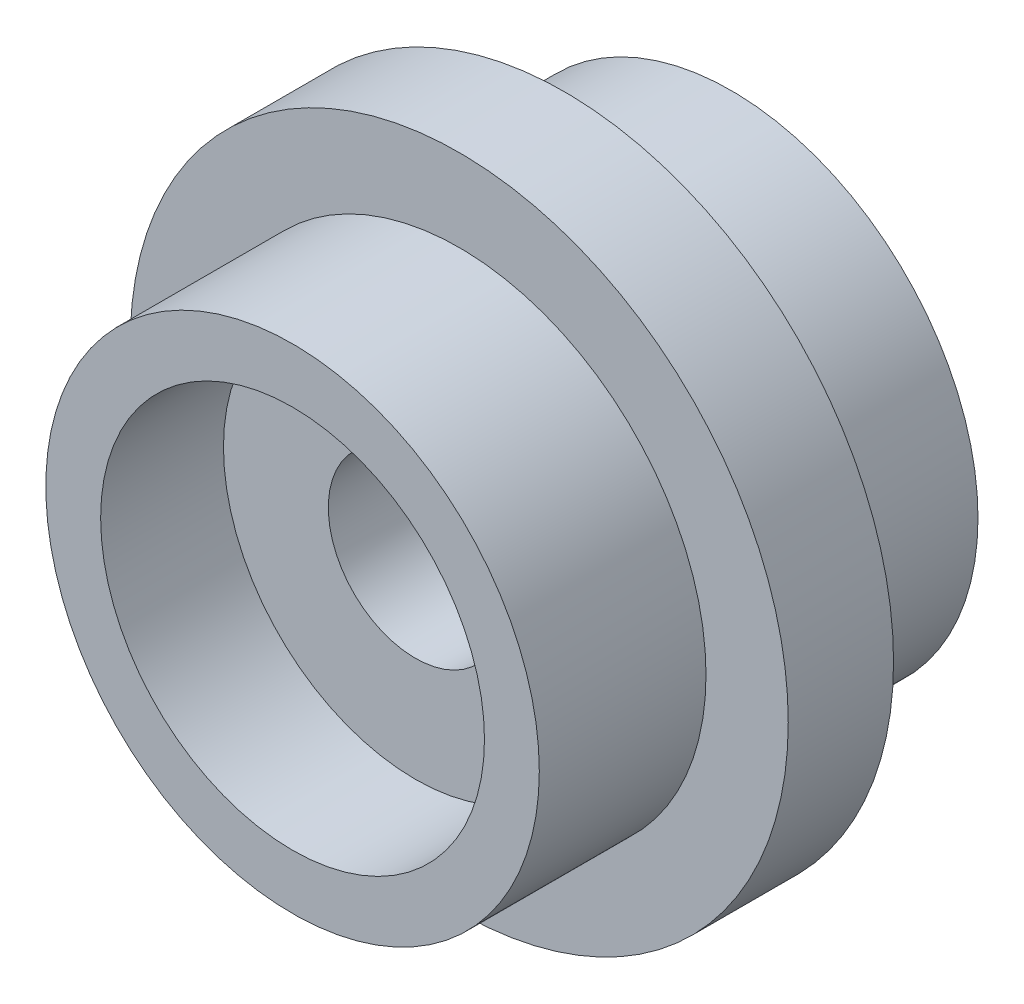
ISO-10303-21;
HEADER;
FILE_DESCRIPTION(('STEP AP214'),'2;1');
FILE_NAME('part.step','',(''),(''),'','','');
FILE_SCHEMA(('AUTOMOTIVE_DESIGN { 1 0 10303 214 1 1 1 1 }'));
ENDSEC;
DATA;
#1=APPLICATION_CONTEXT('core data for automotive mechanical design processes');
#2=APPLICATION_PROTOCOL_DEFINITION('international standard','automotive_design',2000,#1);
#3=PRODUCT_CONTEXT('',#1,'mechanical');
#4=PRODUCT('Part','Part','',(#3));
#5=PRODUCT_RELATED_PRODUCT_CATEGORY('part','',(#4));
#6=PRODUCT_DEFINITION_FORMATION('','',#4);
#7=PRODUCT_DEFINITION_CONTEXT('part definition',#1,'design');
#8=PRODUCT_DEFINITION('design','',#6,#7);
#9=PRODUCT_DEFINITION_SHAPE('','',#8);
#10=(LENGTH_UNIT() NAMED_UNIT(*) SI_UNIT(.MILLI.,.METRE.));
#11=(NAMED_UNIT(*) PLANE_ANGLE_UNIT() SI_UNIT($,.RADIAN.));
#12=(NAMED_UNIT(*) SI_UNIT($,.STERADIAN.) SOLID_ANGLE_UNIT());
#13=UNCERTAINTY_MEASURE_WITH_UNIT(LENGTH_MEASURE(1.E-05),#10,'distance_accuracy_value','');
#14=(GEOMETRIC_REPRESENTATION_CONTEXT(3) GLOBAL_UNCERTAINTY_ASSIGNED_CONTEXT((#13)) GLOBAL_UNIT_ASSIGNED_CONTEXT((#10,
#11,#12)) REPRESENTATION_CONTEXT('',''));
#15=CARTESIAN_POINT('',(0.,0.,0.));
#16=DIRECTION('',(0.,0.,1.));
#17=DIRECTION('',(1.,0.,0.));
#18=AXIS2_PLACEMENT_3D('',#15,#16,#17);
#19=CARTESIAN_POINT('',(0.,0.,0.));
#20=DIRECTION('',(0.,0.,1.));
#21=DIRECTION('',(1.,0.,0.));
#22=AXIS2_PLACEMENT_3D('',#19,#20,#21);
#23=CYLINDRICAL_SURFACE('',#22,5.0419);
#24=CARTESIAN_POINT('',(0.,0.,-7.112));
#25=DIRECTION('',(0.,0.,1.));
#26=DIRECTION('',(1.,0.,0.));
#27=AXIS2_PLACEMENT_3D('',#24,#25,#26);
#28=CIRCLE('',#27,5.0419);
#29=CARTESIAN_POINT('',(5.0419,0.,-7.112));
#30=VERTEX_POINT('',#29);
#31=EDGE_CURVE('E46',#30,#30,#28,.F.);
#32=ORIENTED_EDGE('',*,*,#31,.F.);
#33=EDGE_LOOP('',(#32));
#34=FACE_BOUND('',#33,.T.);
#35=CARTESIAN_POINT('',(0.,0.,-13.335));
#36=DIRECTION('',(0.,0.,-1.));
#37=DIRECTION('',(-1.,0.,0.));
#38=AXIS2_PLACEMENT_3D('',#35,#36,#37);
#39=CIRCLE('',#38,5.0419);
#40=CARTESIAN_POINT('',(-5.0419,0.,-13.335));
#41=VERTEX_POINT('',#40);
#42=EDGE_CURVE('E34',#41,#41,#39,.F.);
#43=ORIENTED_EDGE('',*,*,#42,.F.);
#44=EDGE_LOOP('',(#43));
#45=FACE_BOUND('',#44,.T.);
#46=ADVANCED_FACE('F30',(#34,#45),#23,.F.);
#47=CARTESIAN_POINT('',(0.,0.,0.));
#48=DIRECTION('',(0.,0.,-1.));
#49=DIRECTION('',(-1.,0.,0.));
#50=AXIS2_PLACEMENT_3D('',#47,#48,#49);
#51=PLANE('',#50);
#52=CARTESIAN_POINT('',(0.,0.,0.));
#53=DIRECTION('',(0.,0.,1.));
#54=DIRECTION('',(1.,0.,0.));
#55=AXIS2_PLACEMENT_3D('',#52,#53,#54);
#56=CIRCLE('',#55,11.1125);
#57=CARTESIAN_POINT('',(11.1125,0.,0.));
#58=VERTEX_POINT('',#57);
#59=EDGE_CURVE('E56',#58,#58,#56,.T.);
#60=ORIENTED_EDGE('',*,*,#59,.F.);
#61=EDGE_LOOP('',(#60));
#62=FACE_BOUND('',#61,.T.);
#63=CARTESIAN_POINT('',(0.,0.,0.));
#64=DIRECTION('',(0.,0.,1.));
#65=DIRECTION('',(1.,0.,0.));
#66=AXIS2_PLACEMENT_3D('',#63,#64,#65);
#67=CIRCLE('',#66,14.2875);
#68=CARTESIAN_POINT('',(14.2875,0.,0.));
#69=VERTEX_POINT('',#68);
#70=EDGE_CURVE('E10',#69,#69,#67,.T.);
#71=ORIENTED_EDGE('',*,*,#70,.T.);
#72=EDGE_LOOP('',(#71));
#73=FACE_BOUND('',#72,.T.);
#74=ADVANCED_FACE('F32',(#62,#73),#51,.F.);
#75=CARTESIAN_POINT('',(0.,0.,13.6967088607595));
#76=DIRECTION('',(0.,0.,1.));
#77=DIRECTION('',(1.,0.,0.));
#78=AXIS2_PLACEMENT_3D('',#75,#76,#77);
#79=CYLINDRICAL_SURFACE('',#78,14.2875);
#80=ORIENTED_EDGE('',*,*,#70,.F.);
#81=EDGE_LOOP('',(#80));
#82=FACE_BOUND('',#81,.T.);
#83=CARTESIAN_POINT('',(0.,0.,-9.652));
#84=DIRECTION('',(0.,0.,1.));
#85=DIRECTION('',(1.,0.,0.));
#86=AXIS2_PLACEMENT_3D('',#83,#84,#85);
#87=CIRCLE('',#86,14.2875);
#88=CARTESIAN_POINT('',(14.2875,0.,-9.652));
#89=VERTEX_POINT('',#88);
#90=EDGE_CURVE('E38',#89,#89,#87,.T.);
#91=ORIENTED_EDGE('',*,*,#90,.T.);
#92=EDGE_LOOP('',(#91));
#93=FACE_BOUND('',#92,.T.);
#94=ADVANCED_FACE('F110',(#82,#93),#79,.T.);
#95=CARTESIAN_POINT('',(0.,14.2875,-9.652));
#96=DIRECTION('',(0.,0.,-1.));
#97=DIRECTION('',(-1.,0.,0.));
#98=AXIS2_PLACEMENT_3D('',#95,#96,#97);
#99=PLANE('',#98);
#100=ORIENTED_EDGE('',*,*,#90,.F.);
#101=EDGE_LOOP('',(#100));
#102=FACE_BOUND('',#101,.T.);
#103=CARTESIAN_POINT('',(0.,0.,-9.652));
#104=DIRECTION('',(0.,0.,1.));
#105=DIRECTION('',(1.,0.,0.));
#106=AXIS2_PLACEMENT_3D('',#103,#104,#105);
#107=CIRCLE('',#106,19.05);
#108=CARTESIAN_POINT('',(19.05,0.,-9.652));
#109=VERTEX_POINT('',#108);
#110=EDGE_CURVE('E43',#109,#109,#107,.T.);
#111=ORIENTED_EDGE('',*,*,#110,.T.);
#112=EDGE_LOOP('',(#111));
#113=FACE_BOUND('',#112,.T.);
#114=ADVANCED_FACE('F73',(#102,#113),#99,.F.);
#115=CARTESIAN_POINT('',(0.,0.,13.6967088607595));
#116=DIRECTION('',(0.,0.,1.));
#117=DIRECTION('',(1.,0.,0.));
#118=AXIS2_PLACEMENT_3D('',#115,#116,#117);
#119=CYLINDRICAL_SURFACE('',#118,19.05);
#120=ORIENTED_EDGE('',*,*,#110,.F.);
#121=EDGE_LOOP('',(#120));
#122=FACE_BOUND('',#121,.T.);
#123=CARTESIAN_POINT('',(0.,0.,-15.748));
#124=DIRECTION('',(0.,0.,1.));
#125=DIRECTION('',(1.,0.,0.));
#126=AXIS2_PLACEMENT_3D('',#123,#124,#125);
#127=CIRCLE('',#126,19.05);
#128=CARTESIAN_POINT('',(19.05,0.,-15.748));
#129=VERTEX_POINT('',#128);
#130=EDGE_CURVE('E68',#129,#129,#127,.T.);
#131=ORIENTED_EDGE('',*,*,#130,.T.);
#132=EDGE_LOOP('',(#131));
#133=FACE_BOUND('',#132,.T.);
#134=ADVANCED_FACE('F75',(#122,#133),#119,.T.);
#135=CARTESIAN_POINT('',(0.,19.05,-15.748));
#136=DIRECTION('',(0.,0.,1.));
#137=DIRECTION('',(1.,0.,0.));
#138=AXIS2_PLACEMENT_3D('',#135,#136,#137);
#139=PLANE('',#138);
#140=ORIENTED_EDGE('',*,*,#130,.F.);
#141=EDGE_LOOP('',(#140));
#142=FACE_BOUND('',#141,.T.);
#143=CARTESIAN_POINT('',(0.,0.,-15.748));
#144=DIRECTION('',(0.,0.,1.));
#145=DIRECTION('',(1.,0.,0.));
#146=AXIS2_PLACEMENT_3D('',#143,#144,#145);
#147=CIRCLE('',#146,14.2875);
#148=CARTESIAN_POINT('',(14.2875,0.,-15.748));
#149=VERTEX_POINT('',#148);
#150=EDGE_CURVE('E53',#149,#149,#147,.T.);
#151=ORIENTED_EDGE('',*,*,#150,.T.);
#152=EDGE_LOOP('',(#151));
#153=FACE_BOUND('',#152,.T.);
#154=ADVANCED_FACE('F78',(#142,#153),#139,.F.);
#155=CARTESIAN_POINT('',(0.,0.,13.6967088607595));
#156=DIRECTION('',(0.,0.,1.));
#157=DIRECTION('',(1.,0.,0.));
#158=AXIS2_PLACEMENT_3D('',#155,#156,#157);
#159=CYLINDRICAL_SURFACE('',#158,14.2875);
#160=ORIENTED_EDGE('',*,*,#150,.F.);
#161=EDGE_LOOP('',(#160));
#162=FACE_BOUND('',#161,.T.);
#163=CARTESIAN_POINT('',(0.,0.,-25.4));
#164=DIRECTION('',(0.,0.,1.));
#165=DIRECTION('',(1.,0.,0.));
#166=AXIS2_PLACEMENT_3D('',#163,#164,#165);
#167=CIRCLE('',#166,14.2875);
#168=CARTESIAN_POINT('',(14.2875,0.,-25.4));
#169=VERTEX_POINT('',#168);
#170=EDGE_CURVE('E48',#169,#169,#167,.T.);
#171=ORIENTED_EDGE('',*,*,#170,.T.);
#172=EDGE_LOOP('',(#171));
#173=FACE_BOUND('',#172,.T.);
#174=ADVANCED_FACE('F84',(#162,#173),#159,.T.);
#175=CARTESIAN_POINT('',(0.,14.2875,-25.4));
#176=DIRECTION('',(0.,0.,1.));
#177=DIRECTION('',(1.,0.,0.));
#178=AXIS2_PLACEMENT_3D('',#175,#176,#177);
#179=PLANE('',#178);
#180=CARTESIAN_POINT('',(0.,0.,-25.4));
#181=DIRECTION('',(0.,0.,-1.));
#182=DIRECTION('',(-1.,0.,0.));
#183=AXIS2_PLACEMENT_3D('',#180,#181,#182);
#184=CIRCLE('',#183,11.1125);
#185=CARTESIAN_POINT('',(-11.1125,0.,-25.4));
#186=VERTEX_POINT('',#185);
#187=EDGE_CURVE('E63',#186,#186,#184,.T.);
#188=ORIENTED_EDGE('',*,*,#187,.F.);
#189=EDGE_LOOP('',(#188));
#190=FACE_BOUND('',#189,.T.);
#191=ORIENTED_EDGE('',*,*,#170,.F.);
#192=EDGE_LOOP('',(#191));
#193=FACE_BOUND('',#192,.T.);
#194=ADVANCED_FACE('F90',(#190,#193),#179,.F.);
#195=CARTESIAN_POINT('',(0.,0.,-7.112));
#196=DIRECTION('',(0.,0.,1.));
#197=DIRECTION('',(1.,0.,0.));
#198=AXIS2_PLACEMENT_3D('',#195,#196,#197);
#199=PLANE('',#198);
#200=CARTESIAN_POINT('',(0.,0.,-7.112));
#201=DIRECTION('',(0.,0.,1.));
#202=DIRECTION('',(1.,0.,0.));
#203=AXIS2_PLACEMENT_3D('',#200,#201,#202);
#204=CIRCLE('',#203,11.1125);
#205=CARTESIAN_POINT('',(11.1125,0.,-7.112));
#206=VERTEX_POINT('',#205);
#207=EDGE_CURVE('E49',#206,#206,#204,.T.);
#208=ORIENTED_EDGE('',*,*,#207,.T.);
#209=EDGE_LOOP('',(#208));
#210=FACE_BOUND('',#209,.T.);
#211=ORIENTED_EDGE('',*,*,#31,.T.);
#212=EDGE_LOOP('',(#211));
#213=FACE_BOUND('',#212,.T.);
#214=ADVANCED_FACE('F95',(#210,#213),#199,.T.);
#215=CARTESIAN_POINT('',(0.,0.,-7.112));
#216=DIRECTION('',(0.,0.,1.));
#217=DIRECTION('',(1.,0.,0.));
#218=AXIS2_PLACEMENT_3D('',#215,#216,#217);
#219=CYLINDRICAL_SURFACE('',#218,11.1125);
#220=ORIENTED_EDGE('',*,*,#207,.F.);
#221=EDGE_LOOP('',(#220));
#222=FACE_BOUND('',#221,.T.);
#223=ORIENTED_EDGE('',*,*,#59,.T.);
#224=EDGE_LOOP('',(#223));
#225=FACE_BOUND('',#224,.T.);
#226=ADVANCED_FACE('F101',(#222,#225),#219,.F.);
#227=CARTESIAN_POINT('',(0.,0.,-13.335));
#228=DIRECTION('',(0.,0.,-1.));
#229=DIRECTION('',(-1.,0.,0.));
#230=AXIS2_PLACEMENT_3D('',#227,#228,#229);
#231=PLANE('',#230);
#232=CARTESIAN_POINT('',(0.,0.,-13.335));
#233=DIRECTION('',(0.,0.,-1.));
#234=DIRECTION('',(-1.,0.,0.));
#235=AXIS2_PLACEMENT_3D('',#232,#233,#234);
#236=CIRCLE('',#235,11.1125);
#237=CARTESIAN_POINT('',(-11.1125,0.,-13.335));
#238=VERTEX_POINT('',#237);
#239=EDGE_CURVE('E129',#238,#238,#236,.T.);
#240=ORIENTED_EDGE('',*,*,#239,.T.);
#241=EDGE_LOOP('',(#240));
#242=FACE_BOUND('',#241,.T.);
#243=ORIENTED_EDGE('',*,*,#42,.T.);
#244=EDGE_LOOP('',(#243));
#245=FACE_BOUND('',#244,.T.);
#246=ADVANCED_FACE('F115',(#242,#245),#231,.T.);
#247=CARTESIAN_POINT('',(0.,0.,-13.335));
#248=DIRECTION('',(0.,0.,-1.));
#249=DIRECTION('',(-1.,0.,0.));
#250=AXIS2_PLACEMENT_3D('',#247,#248,#249);
#251=CYLINDRICAL_SURFACE('',#250,11.1125);
#252=ORIENTED_EDGE('',*,*,#239,.F.);
#253=EDGE_LOOP('',(#252));
#254=FACE_BOUND('',#253,.T.);
#255=ORIENTED_EDGE('',*,*,#187,.T.);
#256=EDGE_LOOP('',(#255));
#257=FACE_BOUND('',#256,.T.);
#258=ADVANCED_FACE('F118',(#254,#257),#251,.F.);
#259=CLOSED_SHELL('',(#46,#74,#94,#114,#134,#154,#174,#194,#214,#226,#246,#258));
#260=MANIFOLD_SOLID_BREP('B2',#259);
#261=ADVANCED_BREP_SHAPE_REPRESENTATION('',(#18,#260),#14);
#262=SHAPE_DEFINITION_REPRESENTATION(#9,#261);
ENDSEC;
END-ISO-10303-21;
